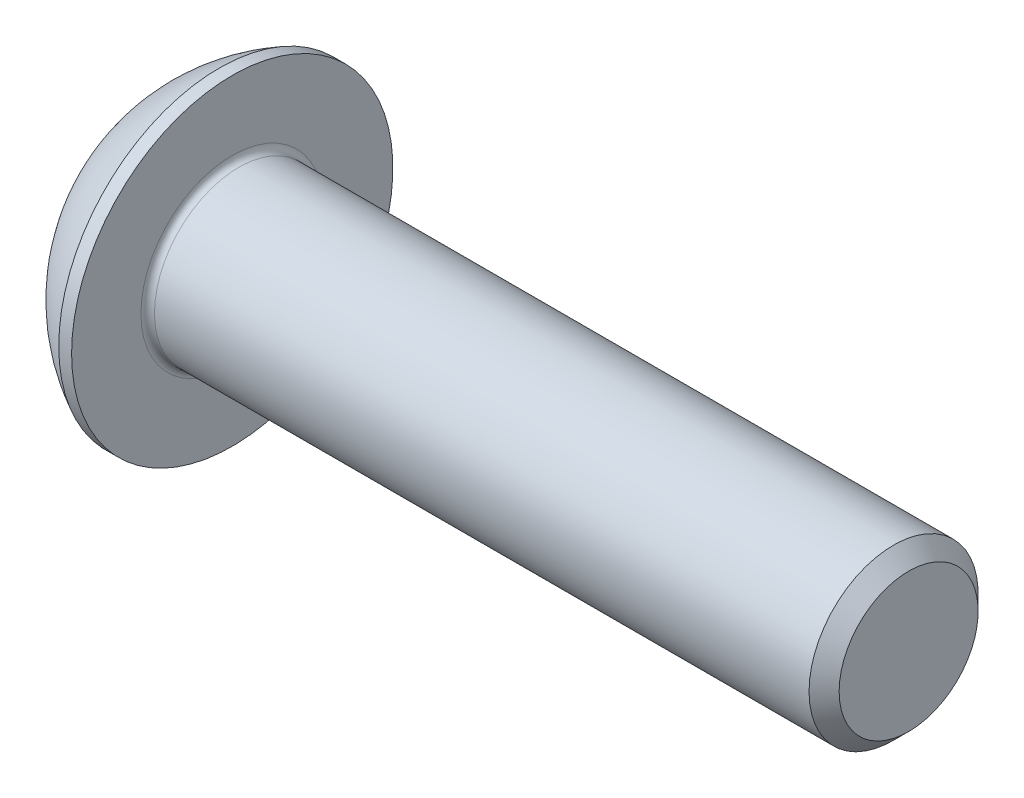
ISO-10303-21;
HEADER;
FILE_DESCRIPTION(('STEP AP214'),'2;1');
FILE_NAME('part.step','',(''),(''),'','','');
FILE_SCHEMA(('AUTOMOTIVE_DESIGN { 1 0 10303 214 1 1 1 1 }'));
ENDSEC;
DATA;
#1=APPLICATION_CONTEXT('core data for automotive mechanical design processes');
#2=APPLICATION_PROTOCOL_DEFINITION('international standard','automotive_design',2000,#1);
#3=PRODUCT_CONTEXT('',#1,'mechanical');
#4=PRODUCT('Part','Part','',(#3));
#5=PRODUCT_RELATED_PRODUCT_CATEGORY('part','',(#4));
#6=PRODUCT_DEFINITION_FORMATION('','',#4);
#7=PRODUCT_DEFINITION_CONTEXT('part definition',#1,'design');
#8=PRODUCT_DEFINITION('design','',#6,#7);
#9=PRODUCT_DEFINITION_SHAPE('','',#8);
#10=(LENGTH_UNIT() NAMED_UNIT(*) SI_UNIT(.MILLI.,.METRE.));
#11=(NAMED_UNIT(*) PLANE_ANGLE_UNIT() SI_UNIT($,.RADIAN.));
#12=(NAMED_UNIT(*) SI_UNIT($,.STERADIAN.) SOLID_ANGLE_UNIT());
#13=UNCERTAINTY_MEASURE_WITH_UNIT(LENGTH_MEASURE(1.E-05),#10,'distance_accuracy_value','');
#14=(GEOMETRIC_REPRESENTATION_CONTEXT(3) GLOBAL_UNCERTAINTY_ASSIGNED_CONTEXT((#13)) GLOBAL_UNIT_ASSIGNED_CONTEXT((#10,
#11,#12)) REPRESENTATION_CONTEXT('',''));
#15=CARTESIAN_POINT('',(0.,0.,0.));
#16=DIRECTION('',(0.,0.,1.));
#17=DIRECTION('',(1.,0.,0.));
#18=AXIS2_PLACEMENT_3D('',#15,#16,#17);
#19=CARTESIAN_POINT('',(0.,0.,0.));
#20=DIRECTION('',(-1.,0.,0.));
#21=DIRECTION('',(0.,0.,1.));
#22=AXIS2_PLACEMENT_3D('',#19,#20,#21);
#23=PLANE('',#22);
#24=CARTESIAN_POINT('',(0.,0.,0.));
#25=DIRECTION('',(-1.,0.,0.));
#26=DIRECTION('',(0.,0.,1.));
#27=AXIS2_PLACEMENT_3D('',#24,#25,#26);
#28=CIRCLE('',#27,2.375);
#29=CARTESIAN_POINT('',(0.,0.,2.375));
#30=VERTEX_POINT('',#29);
#31=EDGE_CURVE('E157',#30,#30,#28,.T.);
#32=ORIENTED_EDGE('',*,*,#31,.T.);
#33=EDGE_LOOP('',(#32));
#34=FACE_BOUND('',#33,.T.);
#35=DIRECTION('',(0.,-1.,0.));
#36=VECTOR('',#35,1.);
#37=CARTESIAN_POINT('',(0.,-0.866025403784438,1.5));
#38=LINE('',#37,#36);
#39=CARTESIAN_POINT('',(0.,0.866025403784439,1.5));
#40=VERTEX_POINT('',#39);
#41=CARTESIAN_POINT('',(0.,-0.866025403784438,1.5));
#42=VERTEX_POINT('',#41);
#43=EDGE_CURVE('E52',#40,#42,#38,.T.);
#44=ORIENTED_EDGE('',*,*,#43,.T.);
#45=DIRECTION('',(0.,-0.500000000000001,-0.866025403784438));
#46=VECTOR('',#45,1.);
#47=CARTESIAN_POINT('',(0.,-1.73205080756888,0.));
#48=LINE('',#47,#46);
#49=CARTESIAN_POINT('',(0.,-1.73205080756888,0.));
#50=VERTEX_POINT('',#49);
#51=EDGE_CURVE('E277',#42,#50,#48,.T.);
#52=ORIENTED_EDGE('',*,*,#51,.T.);
#53=DIRECTION('',(0.,0.500000000000001,-0.866025403784438));
#54=VECTOR('',#53,1.);
#55=CARTESIAN_POINT('',(0.,-0.866025403784438,-1.5));
#56=LINE('',#55,#54);
#57=CARTESIAN_POINT('',(0.,-0.866025403784438,-1.5));
#58=VERTEX_POINT('',#57);
#59=EDGE_CURVE('E132',#50,#58,#56,.T.);
#60=ORIENTED_EDGE('',*,*,#59,.T.);
#61=DIRECTION('',(0.,1.,0.));
#62=VECTOR('',#61,1.);
#63=CARTESIAN_POINT('',(0.,0.866025403784439,-1.5));
#64=LINE('',#63,#62);
#65=CARTESIAN_POINT('',(0.,0.866025403784439,-1.5));
#66=VERTEX_POINT('',#65);
#67=EDGE_CURVE('E280',#58,#66,#64,.T.);
#68=ORIENTED_EDGE('',*,*,#67,.T.);
#69=DIRECTION('',(0.,0.5,0.866025403784439));
#70=VECTOR('',#69,1.);
#71=CARTESIAN_POINT('',(0.,1.73205080756888,0.));
#72=LINE('',#71,#70);
#73=CARTESIAN_POINT('',(0.,1.73205080756888,0.));
#74=VERTEX_POINT('',#73);
#75=EDGE_CURVE('E282',#66,#74,#72,.T.);
#76=ORIENTED_EDGE('',*,*,#75,.T.);
#77=DIRECTION('',(0.,-0.5,0.866025403784439));
#78=VECTOR('',#77,1.);
#79=CARTESIAN_POINT('',(0.,0.866025403784439,1.5));
#80=LINE('',#79,#78);
#81=EDGE_CURVE('E284',#74,#40,#80,.T.);
#82=ORIENTED_EDGE('',*,*,#81,.T.);
#83=EDGE_LOOP('',(#44,#52,#60,#68,#76,#82));
#84=FACE_BOUND('',#83,.T.);
#85=ADVANCED_FACE('F37',(#34,#84),#23,.T.);
#86=CARTESIAN_POINT('',(4.75501582278481,0.,0.));
#87=DIRECTION('',(-1.,0.,0.));
#88=DIRECTION('',(0.,1.,0.));
#89=AXIS2_PLACEMENT_3D('',#86,#87,#88);
#90=SPHERICAL_SURFACE('',#89,5.3151482081814);
#91=CARTESIAN_POINT('',(2.37,0.,0.));
#92=DIRECTION('',(-1.,0.,0.));
#93=DIRECTION('',(0.,0.,1.));
#94=AXIS2_PLACEMENT_3D('',#91,#92,#93);
#95=CIRCLE('',#94,4.75);
#96=CARTESIAN_POINT('',(2.37,0.,4.75));
#97=VERTEX_POINT('',#96);
#98=EDGE_CURVE('E154',#97,#97,#95,.T.);
#99=ORIENTED_EDGE('',*,*,#98,.T.);
#100=EDGE_LOOP('',(#99));
#101=FACE_BOUND('',#100,.T.);
#102=ORIENTED_EDGE('',*,*,#31,.F.);
#103=EDGE_LOOP('',(#102));
#104=FACE_BOUND('',#103,.T.);
#105=ADVANCED_FACE('F178',(#101,#104),#90,.T.);
#106=CARTESIAN_POINT('',(0.,0.,0.));
#107=DIRECTION('',(-1.,0.,0.));
#108=DIRECTION('',(0.,0.,1.));
#109=AXIS2_PLACEMENT_3D('',#106,#107,#108);
#110=CYLINDRICAL_SURFACE('',#109,4.75);
#111=ORIENTED_EDGE('',*,*,#98,.F.);
#112=EDGE_LOOP('',(#111));
#113=FACE_BOUND('',#112,.T.);
#114=CARTESIAN_POINT('',(2.75,0.,0.));
#115=DIRECTION('',(-1.,0.,0.));
#116=DIRECTION('',(0.,0.,1.));
#117=AXIS2_PLACEMENT_3D('',#114,#115,#116);
#118=CIRCLE('',#117,4.75);
#119=CARTESIAN_POINT('',(2.75,0.,4.75));
#120=VERTEX_POINT('',#119);
#121=EDGE_CURVE('E151',#120,#120,#118,.T.);
#122=ORIENTED_EDGE('',*,*,#121,.T.);
#123=EDGE_LOOP('',(#122));
#124=FACE_BOUND('',#123,.T.);
#125=ADVANCED_FACE('F183',(#113,#124),#110,.T.);
#126=CARTESIAN_POINT('',(2.75,2.5,0.));
#127=DIRECTION('',(-1.,0.,0.));
#128=DIRECTION('',(0.,0.,1.));
#129=AXIS2_PLACEMENT_3D('',#126,#127,#128);
#130=PLANE('',#129);
#131=CARTESIAN_POINT('',(2.75,0.,0.));
#132=DIRECTION('',(-1.,0.,0.));
#133=DIRECTION('',(0.,0.,1.));
#134=AXIS2_PLACEMENT_3D('',#131,#132,#133);
#135=CIRCLE('',#134,2.7);
#136=CARTESIAN_POINT('',(2.75,0.,2.7));
#137=VERTEX_POINT('',#136);
#138=EDGE_CURVE('E45',#137,#137,#135,.T.);
#139=ORIENTED_EDGE('',*,*,#138,.T.);
#140=EDGE_LOOP('',(#139));
#141=FACE_BOUND('',#140,.T.);
#142=ORIENTED_EDGE('',*,*,#121,.F.);
#143=EDGE_LOOP('',(#142));
#144=FACE_BOUND('',#143,.T.);
#145=ADVANCED_FACE('F162',(#141,#144),#130,.F.);
#146=CARTESIAN_POINT('',(0.,0.,0.));
#147=DIRECTION('',(-1.,0.,0.));
#148=DIRECTION('',(0.,0.,1.));
#149=AXIS2_PLACEMENT_3D('',#146,#147,#148);
#150=CYLINDRICAL_SURFACE('',#149,2.5);
#151=CARTESIAN_POINT('',(2.95,0.,0.));
#152=DIRECTION('',(-1.,0.,0.));
#153=DIRECTION('',(0.,0.,1.));
#154=AXIS2_PLACEMENT_3D('',#151,#152,#153);
#155=CIRCLE('',#154,2.5);
#156=CARTESIAN_POINT('',(2.95,0.,2.5));
#157=VERTEX_POINT('',#156);
#158=EDGE_CURVE('E11',#157,#157,#155,.F.);
#159=ORIENTED_EDGE('',*,*,#158,.T.);
#160=EDGE_LOOP('',(#159));
#161=FACE_BOUND('',#160,.T.);
#162=CARTESIAN_POINT('',(22.305,0.,0.));
#163=DIRECTION('',(-1.,0.,0.));
#164=DIRECTION('',(0.,0.,1.));
#165=AXIS2_PLACEMENT_3D('',#162,#163,#164);
#166=CIRCLE('',#165,2.5);
#167=CARTESIAN_POINT('',(22.305,0.,2.5));
#168=VERTEX_POINT('',#167);
#169=EDGE_CURVE('E148',#168,#168,#166,.T.);
#170=ORIENTED_EDGE('',*,*,#169,.T.);
#171=EDGE_LOOP('',(#170));
#172=FACE_BOUND('',#171,.T.);
#173=ADVANCED_FACE('F192',(#161,#172),#150,.T.);
#174=CARTESIAN_POINT('',(22.75,0.,0.));
#175=DIRECTION('',(-1.,0.,0.));
#176=DIRECTION('',(0.,0.,1.));
#177=AXIS2_PLACEMENT_3D('',#174,#175,#176);
#178=CONICAL_SURFACE('',#177,2.055,0.785398163397441);
#179=ORIENTED_EDGE('',*,*,#169,.F.);
#180=EDGE_LOOP('',(#179));
#181=FACE_BOUND('',#180,.T.);
#182=CARTESIAN_POINT('',(22.75,0.,0.));
#183=DIRECTION('',(-1.,0.,0.));
#184=DIRECTION('',(0.,0.,1.));
#185=AXIS2_PLACEMENT_3D('',#182,#183,#184);
#186=CIRCLE('',#185,2.055);
#187=CARTESIAN_POINT('',(22.75,0.,2.055));
#188=VERTEX_POINT('',#187);
#189=EDGE_CURVE('E144',#188,#188,#186,.T.);
#190=ORIENTED_EDGE('',*,*,#189,.T.);
#191=EDGE_LOOP('',(#190));
#192=FACE_BOUND('',#191,.T.);
#193=ADVANCED_FACE('F173',(#181,#192),#178,.T.);
#194=CARTESIAN_POINT('',(22.75,0.,0.));
#195=DIRECTION('',(-1.,0.,0.));
#196=DIRECTION('',(0.,0.,1.));
#197=AXIS2_PLACEMENT_3D('',#194,#195,#196);
#198=PLANE('',#197);
#199=ORIENTED_EDGE('',*,*,#189,.F.);
#200=EDGE_LOOP('',(#199));
#201=FACE_BOUND('',#200,.T.);
#202=ADVANCED_FACE('F166',(#201),#198,.F.);
#203=CARTESIAN_POINT('',(2.95,0.,0.));
#204=DIRECTION('',(-1.,0.,0.));
#205=DIRECTION('',(0.,0.,1.));
#206=AXIS2_PLACEMENT_3D('',#203,#204,#205);
#207=TOROIDAL_SURFACE('',#206,2.7,0.2);
#208=ORIENTED_EDGE('',*,*,#158,.F.);
#209=EDGE_LOOP('',(#208));
#210=FACE_BOUND('',#209,.T.);
#211=ORIENTED_EDGE('',*,*,#138,.F.);
#212=EDGE_LOOP('',(#211));
#213=FACE_BOUND('',#212,.T.);
#214=ADVANCED_FACE('F39',(#210,#213),#207,.F.);
#215=CARTESIAN_POINT('',(1.56,-1.73205080756888,0.));
#216=DIRECTION('',(0.,0.866025403784438,-0.500000000000001));
#217=DIRECTION('',(0.,0.500000000000001,0.866025403784438));
#218=AXIS2_PLACEMENT_3D('',#215,#216,#217);
#219=PLANE('',#218);
#220=DIRECTION('',(0.,-0.500000000000001,-0.866025403784438));
#221=VECTOR('',#220,1.);
#222=CARTESIAN_POINT('',(1.56,-1.73205080756888,0.));
#223=LINE('',#222,#221);
#224=CARTESIAN_POINT('',(1.56,-0.866025403784438,1.5));
#225=VERTEX_POINT('',#224);
#226=CARTESIAN_POINT('',(1.56,-1.29903810567666,0.750000000000002));
#227=VERTEX_POINT('',#226);
#228=EDGE_CURVE('E118',#225,#227,#223,.T.);
#229=ORIENTED_EDGE('',*,*,#228,.T.);
#230=CARTESIAN_POINT('',(1.56,-1.73205080756888,0.));
#231=VERTEX_POINT('',#230);
#232=EDGE_CURVE('E113',#227,#231,#223,.T.);
#233=ORIENTED_EDGE('',*,*,#232,.T.);
#234=DIRECTION('',(-1.,0.,0.));
#235=VECTOR('',#234,1.);
#236=CARTESIAN_POINT('',(1.56,-1.73205080756888,0.));
#237=LINE('',#236,#235);
#238=EDGE_CURVE('E115',#231,#50,#237,.T.);
#239=ORIENTED_EDGE('',*,*,#238,.T.);
#240=ORIENTED_EDGE('',*,*,#51,.F.);
#241=DIRECTION('',(-1.,0.,0.));
#242=VECTOR('',#241,1.);
#243=CARTESIAN_POINT('',(1.56,-0.866025403784438,1.5));
#244=LINE('',#243,#242);
#245=EDGE_CURVE('E273',#225,#42,#244,.T.);
#246=ORIENTED_EDGE('',*,*,#245,.F.);
#247=EDGE_LOOP('',(#229,#233,#239,#240,#246));
#248=FACE_BOUND('',#247,.T.);
#249=ADVANCED_FACE('F114',(#248),#219,.T.);
#250=CARTESIAN_POINT('',(1.56,-0.866025403784438,-1.5));
#251=DIRECTION('',(0.,0.866025403784438,0.500000000000001));
#252=DIRECTION('',(0.,-0.500000000000001,0.866025403784438));
#253=AXIS2_PLACEMENT_3D('',#250,#251,#252);
#254=PLANE('',#253);
#255=DIRECTION('',(0.,0.500000000000001,-0.866025403784438));
#256=VECTOR('',#255,1.);
#257=CARTESIAN_POINT('',(1.56,-0.866025403784438,-1.5));
#258=LINE('',#257,#256);
#259=CARTESIAN_POINT('',(1.56,-1.29903810567666,-0.750000000000001));
#260=VERTEX_POINT('',#259);
#261=EDGE_CURVE('E60',#231,#260,#258,.T.);
#262=ORIENTED_EDGE('',*,*,#261,.T.);
#263=CARTESIAN_POINT('',(1.56,-0.866025403784438,-1.5));
#264=VERTEX_POINT('',#263);
#265=EDGE_CURVE('E127',#260,#264,#258,.T.);
#266=ORIENTED_EDGE('',*,*,#265,.T.);
#267=DIRECTION('',(-1.,0.,0.));
#268=VECTOR('',#267,1.);
#269=CARTESIAN_POINT('',(1.56,-0.866025403784438,-1.5));
#270=LINE('',#269,#268);
#271=EDGE_CURVE('E134',#264,#58,#270,.T.);
#272=ORIENTED_EDGE('',*,*,#271,.T.);
#273=ORIENTED_EDGE('',*,*,#59,.F.);
#274=ORIENTED_EDGE('',*,*,#238,.F.);
#275=EDGE_LOOP('',(#262,#266,#272,#273,#274));
#276=FACE_BOUND('',#275,.T.);
#277=ADVANCED_FACE('F130',(#276),#254,.T.);
#278=CARTESIAN_POINT('',(1.56,0.866025403784439,-1.5));
#279=DIRECTION('',(0.,0.,1.));
#280=DIRECTION('',(1.,0.,0.));
#281=AXIS2_PLACEMENT_3D('',#278,#279,#280);
#282=PLANE('',#281);
#283=DIRECTION('',(0.,1.,0.));
#284=VECTOR('',#283,1.);
#285=CARTESIAN_POINT('',(1.56,0.866025403784439,-1.5));
#286=LINE('',#285,#284);
#287=CARTESIAN_POINT('',(1.56,0.,-1.5));
#288=VERTEX_POINT('',#287);
#289=EDGE_CURVE('E254',#264,#288,#286,.T.);
#290=ORIENTED_EDGE('',*,*,#289,.T.);
#291=CARTESIAN_POINT('',(1.56,0.866025403784439,-1.5));
#292=VERTEX_POINT('',#291);
#293=EDGE_CURVE('E126',#288,#292,#286,.T.);
#294=ORIENTED_EDGE('',*,*,#293,.T.);
#295=DIRECTION('',(-1.,0.,0.));
#296=VECTOR('',#295,1.);
#297=CARTESIAN_POINT('',(1.56,0.866025403784439,-1.5));
#298=LINE('',#297,#296);
#299=EDGE_CURVE('E139',#292,#66,#298,.T.);
#300=ORIENTED_EDGE('',*,*,#299,.T.);
#301=ORIENTED_EDGE('',*,*,#67,.F.);
#302=ORIENTED_EDGE('',*,*,#271,.F.);
#303=EDGE_LOOP('',(#290,#294,#300,#301,#302));
#304=FACE_BOUND('',#303,.T.);
#305=ADVANCED_FACE('F206',(#304),#282,.T.);
#306=CARTESIAN_POINT('',(1.56,1.73205080756888,0.));
#307=DIRECTION('',(0.,-0.866025403784439,0.5));
#308=DIRECTION('',(0.,-0.5,-0.866025403784439));
#309=AXIS2_PLACEMENT_3D('',#306,#307,#308);
#310=PLANE('',#309);
#311=DIRECTION('',(0.,0.5,0.866025403784439));
#312=VECTOR('',#311,1.);
#313=CARTESIAN_POINT('',(1.56,1.73205080756888,0.));
#314=LINE('',#313,#312);
#315=CARTESIAN_POINT('',(1.56,1.29903810567666,-0.75));
#316=VERTEX_POINT('',#315);
#317=EDGE_CURVE('E243',#292,#316,#314,.T.);
#318=ORIENTED_EDGE('',*,*,#317,.T.);
#319=CARTESIAN_POINT('',(1.56,1.73205080756888,0.));
#320=VERTEX_POINT('',#319);
#321=EDGE_CURVE('E248',#316,#320,#314,.T.);
#322=ORIENTED_EDGE('',*,*,#321,.T.);
#323=DIRECTION('',(-1.,0.,0.));
#324=VECTOR('',#323,1.);
#325=CARTESIAN_POINT('',(1.56,1.73205080756888,0.));
#326=LINE('',#325,#324);
#327=EDGE_CURVE('E288',#320,#74,#326,.T.);
#328=ORIENTED_EDGE('',*,*,#327,.T.);
#329=ORIENTED_EDGE('',*,*,#75,.F.);
#330=ORIENTED_EDGE('',*,*,#299,.F.);
#331=EDGE_LOOP('',(#318,#322,#328,#329,#330));
#332=FACE_BOUND('',#331,.T.);
#333=ADVANCED_FACE('F209',(#332),#310,.T.);
#334=CARTESIAN_POINT('',(1.56,0.866025403784439,1.5));
#335=DIRECTION('',(0.,-0.866025403784439,-0.5));
#336=DIRECTION('',(0.,0.5,-0.866025403784439));
#337=AXIS2_PLACEMENT_3D('',#334,#335,#336);
#338=PLANE('',#337);
#339=DIRECTION('',(0.,-0.5,0.866025403784439));
#340=VECTOR('',#339,1.);
#341=CARTESIAN_POINT('',(1.56,0.866025403784439,1.5));
#342=LINE('',#341,#340);
#343=CARTESIAN_POINT('',(1.56,1.29903810567666,0.75));
#344=VERTEX_POINT('',#343);
#345=EDGE_CURVE('E251',#320,#344,#342,.T.);
#346=ORIENTED_EDGE('',*,*,#345,.T.);
#347=CARTESIAN_POINT('',(1.56,0.866025403784439,1.5));
#348=VERTEX_POINT('',#347);
#349=EDGE_CURVE('E259',#344,#348,#342,.T.);
#350=ORIENTED_EDGE('',*,*,#349,.T.);
#351=DIRECTION('',(-1.,0.,0.));
#352=VECTOR('',#351,1.);
#353=CARTESIAN_POINT('',(1.56,0.866025403784439,1.5));
#354=LINE('',#353,#352);
#355=EDGE_CURVE('E272',#348,#40,#354,.T.);
#356=ORIENTED_EDGE('',*,*,#355,.T.);
#357=ORIENTED_EDGE('',*,*,#81,.F.);
#358=ORIENTED_EDGE('',*,*,#327,.F.);
#359=EDGE_LOOP('',(#346,#350,#356,#357,#358));
#360=FACE_BOUND('',#359,.T.);
#361=ADVANCED_FACE('F213',(#360),#338,.T.);
#362=CARTESIAN_POINT('',(1.56,-0.866025403784438,1.5));
#363=DIRECTION('',(0.,0.,-1.));
#364=DIRECTION('',(-1.,0.,0.));
#365=AXIS2_PLACEMENT_3D('',#362,#363,#364);
#366=PLANE('',#365);
#367=DIRECTION('',(0.,-1.,0.));
#368=VECTOR('',#367,1.);
#369=CARTESIAN_POINT('',(1.56,-0.866025403784438,1.5));
#370=LINE('',#369,#368);
#371=CARTESIAN_POINT('',(1.56,0.,1.5));
#372=VERTEX_POINT('',#371);
#373=EDGE_CURVE('E265',#348,#372,#370,.T.);
#374=ORIENTED_EDGE('',*,*,#373,.T.);
#375=EDGE_CURVE('E267',#372,#225,#370,.T.);
#376=ORIENTED_EDGE('',*,*,#375,.T.);
#377=ORIENTED_EDGE('',*,*,#245,.T.);
#378=ORIENTED_EDGE('',*,*,#43,.F.);
#379=ORIENTED_EDGE('',*,*,#355,.F.);
#380=EDGE_LOOP('',(#374,#376,#377,#378,#379));
#381=FACE_BOUND('',#380,.T.);
#382=ADVANCED_FACE('F217',(#381),#366,.T.);
#383=CARTESIAN_POINT('',(1.56,-1.73205080756888,0.));
#384=DIRECTION('',(1.,0.,0.));
#385=DIRECTION('',(0.,0.,-1.));
#386=AXIS2_PLACEMENT_3D('',#383,#384,#385);
#387=PLANE('',#386);
#388=CARTESIAN_POINT('',(1.56,0.,0.));
#389=DIRECTION('',(-1.,0.,0.));
#390=DIRECTION('',(0.,0.,1.));
#391=AXIS2_PLACEMENT_3D('',#388,#389,#390);
#392=CIRCLE('',#391,1.5);
#393=EDGE_CURVE('E240',#316,#288,#392,.T.);
#394=ORIENTED_EDGE('',*,*,#393,.F.);
#395=ORIENTED_EDGE('',*,*,#317,.F.);
#396=ORIENTED_EDGE('',*,*,#293,.F.);
#397=EDGE_LOOP('',(#394,#395,#396));
#398=FACE_BOUND('',#397,.T.);
#399=ADVANCED_FACE('F221',(#398),#387,.F.);
#400=EDGE_CURVE('E145',#344,#316,#392,.T.);
#401=ORIENTED_EDGE('',*,*,#400,.F.);
#402=ORIENTED_EDGE('',*,*,#345,.F.);
#403=ORIENTED_EDGE('',*,*,#321,.F.);
#404=EDGE_LOOP('',(#401,#402,#403));
#405=FACE_BOUND('',#404,.T.);
#406=ADVANCED_FACE('F230',(#405),#387,.F.);
#407=EDGE_CURVE('E138',#372,#344,#392,.T.);
#408=ORIENTED_EDGE('',*,*,#407,.F.);
#409=ORIENTED_EDGE('',*,*,#373,.F.);
#410=ORIENTED_EDGE('',*,*,#349,.F.);
#411=EDGE_LOOP('',(#408,#409,#410));
#412=FACE_BOUND('',#411,.T.);
#413=ADVANCED_FACE('F235',(#412),#387,.F.);
#414=EDGE_CURVE('E133',#227,#372,#392,.T.);
#415=ORIENTED_EDGE('',*,*,#414,.F.);
#416=ORIENTED_EDGE('',*,*,#228,.F.);
#417=ORIENTED_EDGE('',*,*,#375,.F.);
#418=EDGE_LOOP('',(#415,#416,#417));
#419=FACE_BOUND('',#418,.T.);
#420=ADVANCED_FACE('F228',(#419),#387,.F.);
#421=EDGE_CURVE('E124',#260,#227,#392,.T.);
#422=ORIENTED_EDGE('',*,*,#421,.F.);
#423=ORIENTED_EDGE('',*,*,#261,.F.);
#424=ORIENTED_EDGE('',*,*,#232,.F.);
#425=EDGE_LOOP('',(#422,#423,#424));
#426=FACE_BOUND('',#425,.T.);
#427=ADVANCED_FACE('F123',(#426),#387,.F.);
#428=EDGE_CURVE('E246',#288,#260,#392,.T.);
#429=ORIENTED_EDGE('',*,*,#428,.F.);
#430=ORIENTED_EDGE('',*,*,#289,.F.);
#431=ORIENTED_EDGE('',*,*,#265,.F.);
#432=EDGE_LOOP('',(#429,#430,#431));
#433=FACE_BOUND('',#432,.T.);
#434=ADVANCED_FACE('F201',(#433),#387,.F.);
#435=CARTESIAN_POINT('',(2.42602540378445,0.,0.));
#436=DIRECTION('',(-1.,0.,0.));
#437=DIRECTION('',(0.,0.,1.));
#438=AXIS2_PLACEMENT_3D('',#435,#436,#437);
#439=CONICAL_SURFACE('',#438,0.,1.04719755119659);
#440=ORIENTED_EDGE('',*,*,#407,.T.);
#441=ORIENTED_EDGE('',*,*,#400,.T.);
#442=ORIENTED_EDGE('',*,*,#393,.T.);
#443=ORIENTED_EDGE('',*,*,#428,.T.);
#444=ORIENTED_EDGE('',*,*,#421,.T.);
#445=ORIENTED_EDGE('',*,*,#414,.T.);
#446=EDGE_LOOP('',(#440,#441,#442,#443,#444,#445));
#447=FACE_BOUND('',#446,.T.);
#448=CARTESIAN_POINT('',(2.42602540378445,0.,0.));
#449=VERTEX_POINT('',#448);
#450=VERTEX_LOOP('',#449);
#451=FACE_BOUND('',#450,.T.);
#452=ADVANCED_FACE('F199',(#447,#451),#439,.F.);
#453=CLOSED_SHELL('',(#85,#105,#125,#145,#173,#193,#202,#214,#249,#277,#305,#333,#361,#382,#399,
#406,#413,#420,#427,#434,#452));
#454=MANIFOLD_SOLID_BREP('B2',#453);
#455=ADVANCED_BREP_SHAPE_REPRESENTATION('',(#18,#454),#14);
#456=SHAPE_DEFINITION_REPRESENTATION(#9,#455);
ENDSEC;
END-ISO-10303-21;
